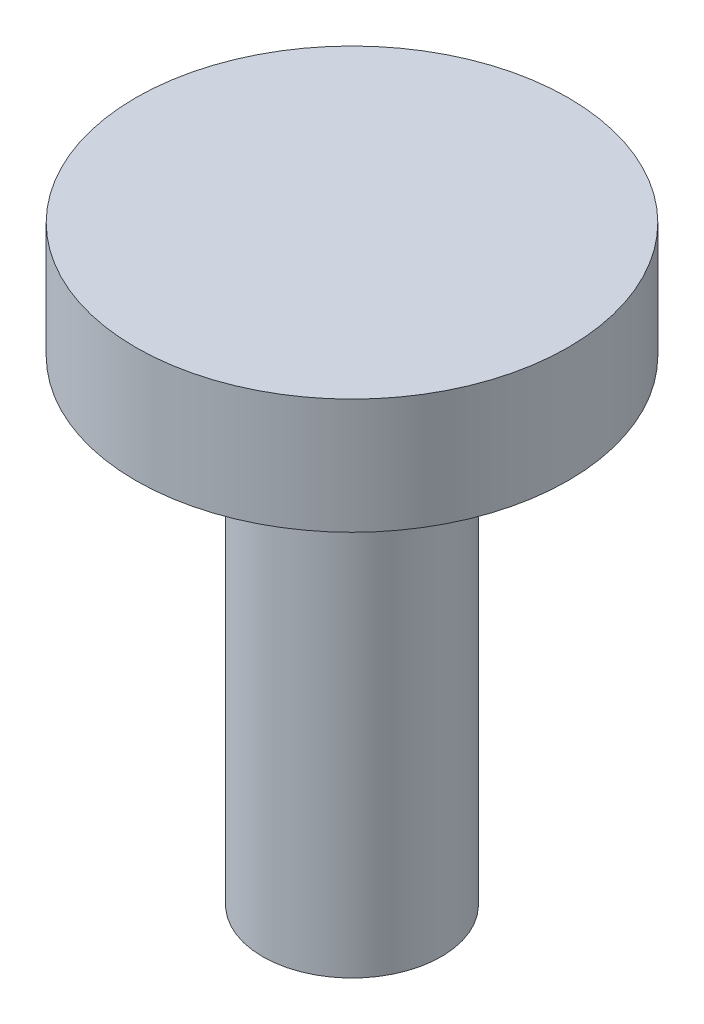
ISO-10303-21;
HEADER;
FILE_DESCRIPTION(('STEP AP214'),'2;1');
FILE_NAME('part.step','',(''),(''),'','','');
FILE_SCHEMA(('AUTOMOTIVE_DESIGN { 1 0 10303 214 1 1 1 1 }'));
ENDSEC;
DATA;
#1=APPLICATION_CONTEXT('core data for automotive mechanical design processes');
#2=APPLICATION_PROTOCOL_DEFINITION('international standard','automotive_design',2000,#1);
#3=PRODUCT_CONTEXT('',#1,'mechanical');
#4=PRODUCT('Part','Part','',(#3));
#5=PRODUCT_RELATED_PRODUCT_CATEGORY('part','',(#4));
#6=PRODUCT_DEFINITION_FORMATION('','',#4);
#7=PRODUCT_DEFINITION_CONTEXT('part definition',#1,'design');
#8=PRODUCT_DEFINITION('design','',#6,#7);
#9=PRODUCT_DEFINITION_SHAPE('','',#8);
#10=(LENGTH_UNIT() NAMED_UNIT(*) SI_UNIT(.MILLI.,.METRE.));
#11=(NAMED_UNIT(*) PLANE_ANGLE_UNIT() SI_UNIT($,.RADIAN.));
#12=(NAMED_UNIT(*) SI_UNIT($,.STERADIAN.) SOLID_ANGLE_UNIT());
#13=UNCERTAINTY_MEASURE_WITH_UNIT(LENGTH_MEASURE(1.E-05),#10,'distance_accuracy_value','');
#14=(GEOMETRIC_REPRESENTATION_CONTEXT(3) GLOBAL_UNCERTAINTY_ASSIGNED_CONTEXT((#13)) GLOBAL_UNIT_ASSIGNED_CONTEXT((#10,
#11,#12)) REPRESENTATION_CONTEXT('',''));
#15=CARTESIAN_POINT('',(0.,0.,0.));
#16=DIRECTION('',(0.,0.,1.));
#17=DIRECTION('',(1.,0.,0.));
#18=AXIS2_PLACEMENT_3D('',#15,#16,#17);
#19=CARTESIAN_POINT('',(0.,16.5,0.));
#20=DIRECTION('',(0.,-1.,0.));
#21=DIRECTION('',(0.,0.,-1.));
#22=AXIS2_PLACEMENT_3D('',#19,#20,#21);
#23=CYLINDRICAL_SURFACE('',#22,3.1);
#24=CARTESIAN_POINT('',(0.,16.5,0.));
#25=DIRECTION('',(0.,1.,0.));
#26=DIRECTION('',(0.,0.,1.));
#27=AXIS2_PLACEMENT_3D('',#24,#25,#26);
#28=CIRCLE('',#27,3.1);
#29=CARTESIAN_POINT('',(0.,16.5,3.1));
#30=VERTEX_POINT('',#29);
#31=EDGE_CURVE('E10',#30,#30,#28,.T.);
#32=ORIENTED_EDGE('',*,*,#31,.F.);
#33=EDGE_LOOP('',(#32));
#34=FACE_BOUND('',#33,.T.);
#35=CARTESIAN_POINT('',(0.,0.,0.));
#36=DIRECTION('',(0.,1.,0.));
#37=DIRECTION('',(0.,0.,1.));
#38=AXIS2_PLACEMENT_3D('',#35,#36,#37);
#39=CIRCLE('',#38,3.1);
#40=CARTESIAN_POINT('',(0.,0.,3.1));
#41=VERTEX_POINT('',#40);
#42=EDGE_CURVE('E42',#41,#41,#39,.T.);
#43=ORIENTED_EDGE('',*,*,#42,.T.);
#44=EDGE_LOOP('',(#43));
#45=FACE_BOUND('',#44,.T.);
#46=ADVANCED_FACE('F39',(#34,#45),#23,.T.);
#47=CARTESIAN_POINT('',(0.,0.,0.));
#48=DIRECTION('',(0.,1.,0.));
#49=DIRECTION('',(0.,0.,1.));
#50=AXIS2_PLACEMENT_3D('',#47,#48,#49);
#51=PLANE('',#50);
#52=ORIENTED_EDGE('',*,*,#42,.F.);
#53=EDGE_LOOP('',(#52));
#54=FACE_BOUND('',#53,.T.);
#55=ADVANCED_FACE('F62',(#54),#51,.F.);
#56=CARTESIAN_POINT('',(0.,20.5,0.));
#57=DIRECTION('',(0.,-1.,0.));
#58=DIRECTION('',(0.,0.,-1.));
#59=AXIS2_PLACEMENT_3D('',#56,#57,#58);
#60=CYLINDRICAL_SURFACE('',#59,7.5);
#61=CARTESIAN_POINT('',(0.,20.5,0.));
#62=DIRECTION('',(0.,1.,0.));
#63=DIRECTION('',(0.,0.,1.));
#64=AXIS2_PLACEMENT_3D('',#61,#62,#63);
#65=CIRCLE('',#64,7.5);
#66=CARTESIAN_POINT('',(0.,20.5,7.5));
#67=VERTEX_POINT('',#66);
#68=EDGE_CURVE('E49',#67,#67,#65,.T.);
#69=ORIENTED_EDGE('',*,*,#68,.F.);
#70=EDGE_LOOP('',(#69));
#71=FACE_BOUND('',#70,.T.);
#72=CARTESIAN_POINT('',(0.,16.5,0.));
#73=DIRECTION('',(0.,1.,0.));
#74=DIRECTION('',(0.,0.,1.));
#75=AXIS2_PLACEMENT_3D('',#72,#73,#74);
#76=CIRCLE('',#75,7.5);
#77=CARTESIAN_POINT('',(0.,16.5,7.5));
#78=VERTEX_POINT('',#77);
#79=EDGE_CURVE('E51',#78,#78,#76,.T.);
#80=ORIENTED_EDGE('',*,*,#79,.T.);
#81=EDGE_LOOP('',(#80));
#82=FACE_BOUND('',#81,.T.);
#83=ADVANCED_FACE('F59',(#71,#82),#60,.T.);
#84=CARTESIAN_POINT('',(0.,20.5,0.));
#85=DIRECTION('',(0.,1.,0.));
#86=DIRECTION('',(0.,0.,1.));
#87=AXIS2_PLACEMENT_3D('',#84,#85,#86);
#88=PLANE('',#87);
#89=ORIENTED_EDGE('',*,*,#68,.T.);
#90=EDGE_LOOP('',(#89));
#91=FACE_BOUND('',#90,.T.);
#92=ADVANCED_FACE('F57',(#91),#88,.T.);
#93=CARTESIAN_POINT('',(0.,16.5,0.));
#94=DIRECTION('',(0.,1.,0.));
#95=DIRECTION('',(0.,0.,1.));
#96=AXIS2_PLACEMENT_3D('',#93,#94,#95);
#97=PLANE('',#96);
#98=ORIENTED_EDGE('',*,*,#31,.T.);
#99=EDGE_LOOP('',(#98));
#100=FACE_BOUND('',#99,.T.);
#101=ORIENTED_EDGE('',*,*,#79,.F.);
#102=EDGE_LOOP('',(#101));
#103=FACE_BOUND('',#102,.T.);
#104=ADVANCED_FACE('F66',(#100,#103),#97,.F.);
#105=CLOSED_SHELL('',(#46,#55,#83,#92,#104));
#106=MANIFOLD_SOLID_BREP('B2',#105);
#107=ADVANCED_BREP_SHAPE_REPRESENTATION('',(#18,#106),#14);
#108=SHAPE_DEFINITION_REPRESENTATION(#9,#107);
ENDSEC;
END-ISO-10303-21;
